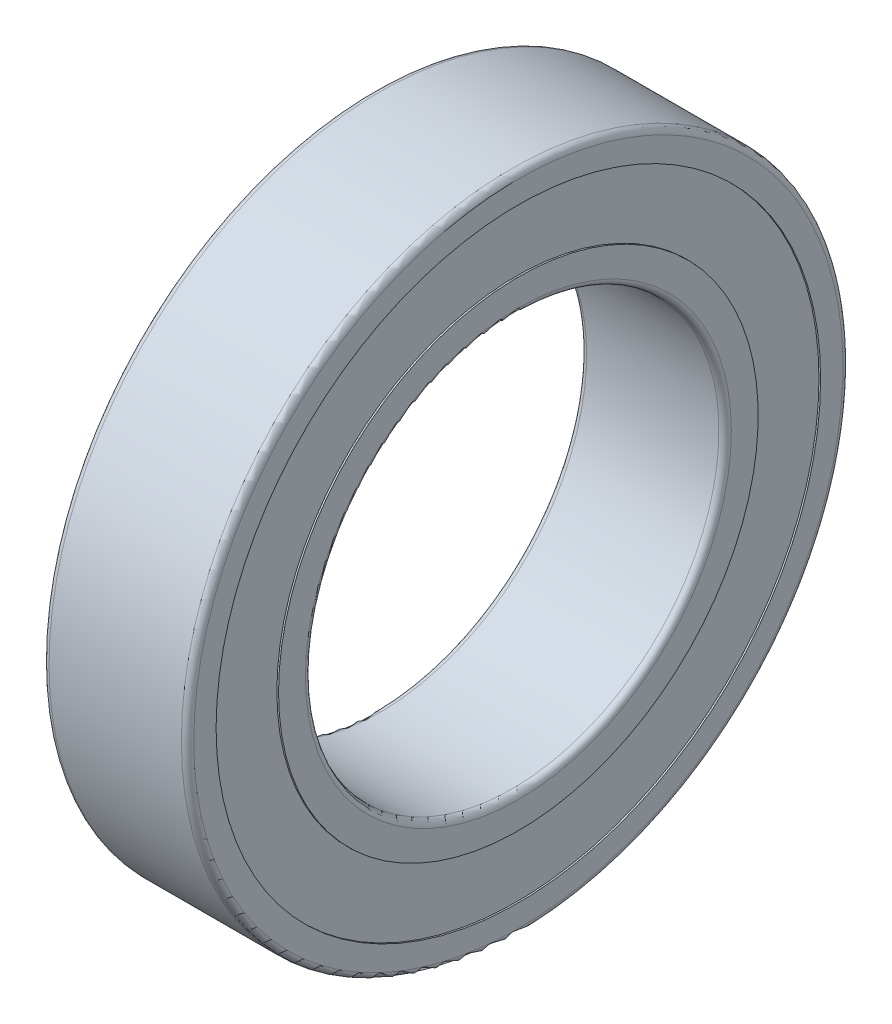
ISO-10303-21;
HEADER;
FILE_DESCRIPTION(('STEP AP214'),'2;1');
FILE_NAME('part.step','',(''),(''),'','','');
FILE_SCHEMA(('AUTOMOTIVE_DESIGN { 1 0 10303 214 1 1 1 1 }'));
ENDSEC;
DATA;
#1=APPLICATION_CONTEXT('core data for automotive mechanical design processes');
#2=APPLICATION_PROTOCOL_DEFINITION('international standard','automotive_design',2000,#1);
#3=PRODUCT_CONTEXT('',#1,'mechanical');
#4=PRODUCT('Part','Part','',(#3));
#5=PRODUCT_RELATED_PRODUCT_CATEGORY('part','',(#4));
#6=PRODUCT_DEFINITION_FORMATION('','',#4);
#7=PRODUCT_DEFINITION_CONTEXT('part definition',#1,'design');
#8=PRODUCT_DEFINITION('design','',#6,#7);
#9=PRODUCT_DEFINITION_SHAPE('','',#8);
#10=(LENGTH_UNIT() NAMED_UNIT(*) SI_UNIT(.MILLI.,.METRE.));
#11=(NAMED_UNIT(*) PLANE_ANGLE_UNIT() SI_UNIT($,.RADIAN.));
#12=(NAMED_UNIT(*) SI_UNIT($,.STERADIAN.) SOLID_ANGLE_UNIT());
#13=UNCERTAINTY_MEASURE_WITH_UNIT(LENGTH_MEASURE(1.E-05),#10,'distance_accuracy_value','');
#14=(GEOMETRIC_REPRESENTATION_CONTEXT(3) GLOBAL_UNCERTAINTY_ASSIGNED_CONTEXT((#13)) GLOBAL_UNIT_ASSIGNED_CONTEXT((#10,
#11,#12)) REPRESENTATION_CONTEXT('',''));
#15=CARTESIAN_POINT('',(0.,0.,0.));
#16=DIRECTION('',(0.,0.,1.));
#17=DIRECTION('',(1.,0.,0.));
#18=AXIS2_PLACEMENT_3D('',#15,#16,#17);
#19=CARTESIAN_POINT('',(0.,-11.9169579088422,-11.6));
#20=DIRECTION('',(-1.,0.,0.));
#21=DIRECTION('',(0.,0.,1.));
#22=AXIS2_PLACEMENT_3D('',#19,#20,#21);
#23=PLANE('',#22);
#24=CARTESIAN_POINT('',(0.,0.,0.));
#25=DIRECTION('',(-1.,0.,0.));
#26=DIRECTION('',(0.,0.,-1.));
#27=AXIS2_PLACEMENT_3D('',#24,#25,#26);
#28=CIRCLE('',#27,11.6);
#29=CARTESIAN_POINT('',(0.,0.,-11.6));
#30=VERTEX_POINT('',#29);
#31=EDGE_CURVE('E68',#30,#30,#28,.F.);
#32=ORIENTED_EDGE('',*,*,#31,.F.);
#33=EDGE_LOOP('',(#32));
#34=FACE_BOUND('',#33,.T.);
#35=CARTESIAN_POINT('',(0.,0.,0.));
#36=DIRECTION('',(1.,0.,0.));
#37=DIRECTION('',(0.,0.,1.));
#38=AXIS2_PLACEMENT_3D('',#35,#36,#37);
#39=CIRCLE('',#38,10.3);
#40=CARTESIAN_POINT('',(0.,0.,10.3));
#41=VERTEX_POINT('',#40);
#42=EDGE_CURVE('E65',#41,#41,#39,.T.);
#43=ORIENTED_EDGE('',*,*,#42,.T.);
#44=EDGE_LOOP('',(#43));
#45=FACE_BOUND('',#44,.T.);
#46=ADVANCED_FACE('F15',(#34,#45),#23,.T.);
#47=CARTESIAN_POINT('',(7.,-11.9169579088422,11.6));
#48=DIRECTION('',(1.,0.,0.));
#49=DIRECTION('',(0.,0.,-1.));
#50=AXIS2_PLACEMENT_3D('',#47,#48,#49);
#51=PLANE('',#50);
#52=CARTESIAN_POINT('',(7.,0.,0.));
#53=DIRECTION('',(1.,0.,0.));
#54=DIRECTION('',(0.,0.,1.));
#55=AXIS2_PLACEMENT_3D('',#52,#53,#54);
#56=CIRCLE('',#55,11.6);
#57=CARTESIAN_POINT('',(7.,0.,11.6));
#58=VERTEX_POINT('',#57);
#59=EDGE_CURVE('E62',#58,#58,#56,.T.);
#60=ORIENTED_EDGE('',*,*,#59,.T.);
#61=EDGE_LOOP('',(#60));
#62=FACE_BOUND('',#61,.T.);
#63=CARTESIAN_POINT('',(7.,0.,0.));
#64=DIRECTION('',(-1.,0.,0.));
#65=DIRECTION('',(0.,0.,-1.));
#66=AXIS2_PLACEMENT_3D('',#63,#64,#65);
#67=CIRCLE('',#66,10.3);
#68=CARTESIAN_POINT('',(7.,0.,-10.3));
#69=VERTEX_POINT('',#68);
#70=EDGE_CURVE('E59',#69,#69,#67,.F.);
#71=ORIENTED_EDGE('',*,*,#70,.F.);
#72=EDGE_LOOP('',(#71));
#73=FACE_BOUND('',#72,.T.);
#74=ADVANCED_FACE('F76',(#62,#73),#51,.T.);
#75=CARTESIAN_POINT('',(6.9195,-14.8915861455195,14.62));
#76=DIRECTION('',(1.,0.,0.));
#77=DIRECTION('',(0.,0.,-1.));
#78=AXIS2_PLACEMENT_3D('',#75,#76,#77);
#79=PLANE('',#78);
#80=CARTESIAN_POINT('',(6.9195,0.,0.));
#81=DIRECTION('',(1.,0.,0.));
#82=DIRECTION('',(0.,0.,1.));
#83=AXIS2_PLACEMENT_3D('',#80,#81,#82);
#84=CIRCLE('',#83,14.62);
#85=CARTESIAN_POINT('',(6.9195,0.,14.62));
#86=VERTEX_POINT('',#85);
#87=EDGE_CURVE('E56',#86,#86,#84,.T.);
#88=ORIENTED_EDGE('',*,*,#87,.T.);
#89=EDGE_LOOP('',(#88));
#90=FACE_BOUND('',#89,.T.);
#91=CARTESIAN_POINT('',(6.9195,0.,0.));
#92=DIRECTION('',(-1.,0.,0.));
#93=DIRECTION('',(0.,0.,-1.));
#94=AXIS2_PLACEMENT_3D('',#91,#92,#93);
#95=CIRCLE('',#94,11.6);
#96=CARTESIAN_POINT('',(6.9195,0.,-11.6));
#97=VERTEX_POINT('',#96);
#98=EDGE_CURVE('E53',#97,#97,#95,.F.);
#99=ORIENTED_EDGE('',*,*,#98,.F.);
#100=EDGE_LOOP('',(#99));
#101=FACE_BOUND('',#100,.T.);
#102=ADVANCED_FACE('F135',(#90,#101),#79,.T.);
#103=CARTESIAN_POINT('',(7.,-15.9916485694488,15.7));
#104=DIRECTION('',(1.,0.,0.));
#105=DIRECTION('',(0.,0.,-1.));
#106=AXIS2_PLACEMENT_3D('',#103,#104,#105);
#107=PLANE('',#106);
#108=CARTESIAN_POINT('',(7.,0.,0.));
#109=DIRECTION('',(1.,0.,0.));
#110=DIRECTION('',(0.,-1.16842937307115E-09,1.));
#111=AXIS2_PLACEMENT_3D('',#108,#109,#110);
#112=CIRCLE('',#111,15.7);
#113=CARTESIAN_POINT('',(7.,-1.83443411572171E-08,15.7));
#114=VERTEX_POINT('',#113);
#115=EDGE_CURVE('E50',#114,#114,#112,.T.);
#116=ORIENTED_EDGE('',*,*,#115,.T.);
#117=EDGE_LOOP('',(#116));
#118=FACE_BOUND('',#117,.T.);
#119=CARTESIAN_POINT('',(7.,0.,0.));
#120=DIRECTION('',(-1.,0.,0.));
#121=DIRECTION('',(0.,0.,-1.));
#122=AXIS2_PLACEMENT_3D('',#119,#120,#121);
#123=CIRCLE('',#122,14.62);
#124=CARTESIAN_POINT('',(7.,0.,-14.62));
#125=VERTEX_POINT('',#124);
#126=EDGE_CURVE('E47',#125,#125,#123,.F.);
#127=ORIENTED_EDGE('',*,*,#126,.F.);
#128=EDGE_LOOP('',(#127));
#129=FACE_BOUND('',#128,.T.);
#130=ADVANCED_FACE('F130',(#118,#129),#107,.T.);
#131=CARTESIAN_POINT('',(0.,-15.9916485967617,-15.7));
#132=DIRECTION('',(-1.,0.,0.));
#133=DIRECTION('',(0.,0.,1.));
#134=AXIS2_PLACEMENT_3D('',#131,#132,#133);
#135=PLANE('',#134);
#136=CARTESIAN_POINT('',(0.,0.,0.));
#137=DIRECTION('',(-1.,0.,0.));
#138=DIRECTION('',(0.,0.,-1.));
#139=AXIS2_PLACEMENT_3D('',#136,#137,#138);
#140=CIRCLE('',#139,15.7);
#141=CARTESIAN_POINT('',(0.,0.,-15.7));
#142=VERTEX_POINT('',#141);
#143=EDGE_CURVE('E44',#142,#142,#140,.F.);
#144=ORIENTED_EDGE('',*,*,#143,.F.);
#145=EDGE_LOOP('',(#144));
#146=FACE_BOUND('',#145,.T.);
#147=CARTESIAN_POINT('',(0.,0.,0.));
#148=DIRECTION('',(1.,0.,0.));
#149=DIRECTION('',(0.,0.,1.));
#150=AXIS2_PLACEMENT_3D('',#147,#148,#149);
#151=CIRCLE('',#150,14.62);
#152=CARTESIAN_POINT('',(0.,0.,14.62));
#153=VERTEX_POINT('',#152);
#154=EDGE_CURVE('E41',#153,#153,#151,.T.);
#155=ORIENTED_EDGE('',*,*,#154,.T.);
#156=EDGE_LOOP('',(#155));
#157=FACE_BOUND('',#156,.T.);
#158=ADVANCED_FACE('F94',(#146,#157),#135,.T.);
#159=CARTESIAN_POINT('',(0.0805,-14.8915861455195,-14.62));
#160=DIRECTION('',(-1.,0.,0.));
#161=DIRECTION('',(0.,0.,1.));
#162=AXIS2_PLACEMENT_3D('',#159,#160,#161);
#163=PLANE('',#162);
#164=CARTESIAN_POINT('',(0.0805,0.,0.));
#165=DIRECTION('',(-1.,0.,0.));
#166=DIRECTION('',(0.,0.,-1.));
#167=AXIS2_PLACEMENT_3D('',#164,#165,#166);
#168=CIRCLE('',#167,14.62);
#169=CARTESIAN_POINT('',(0.0805,0.,-14.62));
#170=VERTEX_POINT('',#169);
#171=EDGE_CURVE('E38',#170,#170,#168,.F.);
#172=ORIENTED_EDGE('',*,*,#171,.F.);
#173=EDGE_LOOP('',(#172));
#174=FACE_BOUND('',#173,.T.);
#175=CARTESIAN_POINT('',(0.0805,0.,0.));
#176=DIRECTION('',(1.,0.,0.));
#177=DIRECTION('',(0.,0.,1.));
#178=AXIS2_PLACEMENT_3D('',#175,#176,#177);
#179=CIRCLE('',#178,11.6);
#180=CARTESIAN_POINT('',(0.0805,0.,11.6));
#181=VERTEX_POINT('',#180);
#182=EDGE_CURVE('E35',#181,#181,#179,.T.);
#183=ORIENTED_EDGE('',*,*,#182,.T.);
#184=EDGE_LOOP('',(#183));
#185=FACE_BOUND('',#184,.T.);
#186=ADVANCED_FACE('F83',(#174,#185),#163,.T.);
#187=CARTESIAN_POINT('',(0.299999999999938,0.,0.));
#188=DIRECTION('',(1.,0.,0.));
#189=DIRECTION('',(0.,0.,1.));
#190=AXIS2_PLACEMENT_3D('',#187,#188,#189);
#191=TOROIDAL_SURFACE('',#190,10.3,0.299999999999938);
#192=CARTESIAN_POINT('',(0.3,0.,0.));
#193=DIRECTION('',(1.,0.,0.));
#194=DIRECTION('',(0.,0.,1.));
#195=AXIS2_PLACEMENT_3D('',#192,#193,#194);
#196=CIRCLE('',#195,10.0000000000001);
#197=CARTESIAN_POINT('',(0.3,0.,10.0000000000001));
#198=VERTEX_POINT('',#197);
#199=EDGE_CURVE('E30',#198,#198,#196,.T.);
#200=ORIENTED_EDGE('',*,*,#199,.T.);
#201=EDGE_LOOP('',(#200));
#202=FACE_BOUND('',#201,.T.);
#203=ORIENTED_EDGE('',*,*,#42,.F.);
#204=EDGE_LOOP('',(#203));
#205=FACE_BOUND('',#204,.T.);
#206=ADVANCED_FACE('F80',(#202,#205),#191,.T.);
#207=CARTESIAN_POINT('',(7.,0.,0.));
#208=DIRECTION('',(1.,0.,0.));
#209=DIRECTION('',(0.,0.,1.));
#210=AXIS2_PLACEMENT_3D('',#207,#208,#209);
#211=CYLINDRICAL_SURFACE('',#210,10.);
#212=CARTESIAN_POINT('',(6.7,0.,0.));
#213=DIRECTION('',(1.,0.,0.));
#214=DIRECTION('',(0.,0.,1.));
#215=AXIS2_PLACEMENT_3D('',#212,#213,#214);
#216=CIRCLE('',#215,10.);
#217=CARTESIAN_POINT('',(6.7,0.,10.));
#218=VERTEX_POINT('',#217);
#219=EDGE_CURVE('E26',#218,#218,#216,.T.);
#220=ORIENTED_EDGE('',*,*,#219,.T.);
#221=EDGE_LOOP('',(#220));
#222=FACE_BOUND('',#221,.T.);
#223=ORIENTED_EDGE('',*,*,#199,.F.);
#224=EDGE_LOOP('',(#223));
#225=FACE_BOUND('',#224,.T.);
#226=ADVANCED_FACE('F82',(#222,#225),#211,.F.);
#227=CARTESIAN_POINT('',(6.70000000000012,0.,0.));
#228=DIRECTION('',(1.,0.,0.));
#229=DIRECTION('',(0.,0.,1.));
#230=AXIS2_PLACEMENT_3D('',#227,#228,#229);
#231=TOROIDAL_SURFACE('',#230,10.2999999999999,0.299999999999877);
#232=ORIENTED_EDGE('',*,*,#70,.T.);
#233=EDGE_LOOP('',(#232));
#234=FACE_BOUND('',#233,.T.);
#235=ORIENTED_EDGE('',*,*,#219,.F.);
#236=EDGE_LOOP('',(#235));
#237=FACE_BOUND('',#236,.T.);
#238=ADVANCED_FACE('F91',(#234,#237),#231,.T.);
#239=CARTESIAN_POINT('',(7.,0.,0.));
#240=DIRECTION('',(1.,0.,0.));
#241=DIRECTION('',(0.,0.,1.));
#242=AXIS2_PLACEMENT_3D('',#239,#240,#241);
#243=CYLINDRICAL_SURFACE('',#242,11.6);
#244=ORIENTED_EDGE('',*,*,#98,.T.);
#245=EDGE_LOOP('',(#244));
#246=FACE_BOUND('',#245,.T.);
#247=ORIENTED_EDGE('',*,*,#59,.F.);
#248=EDGE_LOOP('',(#247));
#249=FACE_BOUND('',#248,.T.);
#250=ADVANCED_FACE('F101',(#246,#249),#243,.T.);
#251=CARTESIAN_POINT('',(7.,0.,0.));
#252=DIRECTION('',(1.,0.,0.));
#253=DIRECTION('',(0.,0.,1.));
#254=AXIS2_PLACEMENT_3D('',#251,#252,#253);
#255=CYLINDRICAL_SURFACE('',#254,14.62);
#256=ORIENTED_EDGE('',*,*,#126,.T.);
#257=EDGE_LOOP('',(#256));
#258=FACE_BOUND('',#257,.T.);
#259=ORIENTED_EDGE('',*,*,#87,.F.);
#260=EDGE_LOOP('',(#259));
#261=FACE_BOUND('',#260,.T.);
#262=ADVANCED_FACE('F105',(#258,#261),#255,.F.);
#263=CARTESIAN_POINT('',(6.70000000000012,0.,0.));
#264=DIRECTION('',(1.,0.,0.));
#265=DIRECTION('',(0.,0.,1.));
#266=AXIS2_PLACEMENT_3D('',#263,#264,#265);
#267=TOROIDAL_SURFACE('',#266,15.7,0.29999999999988);
#268=CARTESIAN_POINT('',(6.70000000000012,0.,0.));
#269=DIRECTION('',(1.,0.,0.));
#270=DIRECTION('',(0.,0.,1.));
#271=AXIS2_PLACEMENT_3D('',#268,#269,#270);
#272=CIRCLE('',#271,15.9999999999999);
#273=CARTESIAN_POINT('',(6.70000000000012,0.,15.9999999999999));
#274=VERTEX_POINT('',#273);
#275=EDGE_CURVE('E22',#274,#274,#272,.T.);
#276=ORIENTED_EDGE('',*,*,#275,.T.);
#277=EDGE_LOOP('',(#276));
#278=FACE_BOUND('',#277,.T.);
#279=ORIENTED_EDGE('',*,*,#115,.F.);
#280=EDGE_LOOP('',(#279));
#281=FACE_BOUND('',#280,.T.);
#282=ADVANCED_FACE('F109',(#278,#281),#267,.T.);
#283=CARTESIAN_POINT('',(7.,0.,0.));
#284=DIRECTION('',(1.,0.,0.));
#285=DIRECTION('',(0.,0.,1.));
#286=AXIS2_PLACEMENT_3D('',#283,#284,#285);
#287=CYLINDRICAL_SURFACE('',#286,16.);
#288=CARTESIAN_POINT('',(0.3,0.,0.));
#289=DIRECTION('',(1.,0.,0.));
#290=DIRECTION('',(0.,0.,1.));
#291=AXIS2_PLACEMENT_3D('',#288,#289,#290);
#292=CIRCLE('',#291,16.);
#293=CARTESIAN_POINT('',(0.3,0.,16.));
#294=VERTEX_POINT('',#293);
#295=EDGE_CURVE('E10',#294,#294,#292,.T.);
#296=ORIENTED_EDGE('',*,*,#295,.T.);
#297=EDGE_LOOP('',(#296));
#298=FACE_BOUND('',#297,.T.);
#299=ORIENTED_EDGE('',*,*,#275,.F.);
#300=EDGE_LOOP('',(#299));
#301=FACE_BOUND('',#300,.T.);
#302=ADVANCED_FACE('F113',(#298,#301),#287,.T.);
#303=CARTESIAN_POINT('',(0.299999999999941,0.,0.));
#304=DIRECTION('',(1.,0.,0.));
#305=DIRECTION('',(0.,0.,1.));
#306=AXIS2_PLACEMENT_3D('',#303,#304,#305);
#307=TOROIDAL_SURFACE('',#306,15.7,0.299999999999939);
#308=ORIENTED_EDGE('',*,*,#143,.T.);
#309=EDGE_LOOP('',(#308));
#310=FACE_BOUND('',#309,.T.);
#311=ORIENTED_EDGE('',*,*,#295,.F.);
#312=EDGE_LOOP('',(#311));
#313=FACE_BOUND('',#312,.T.);
#314=ADVANCED_FACE('F116',(#310,#313),#307,.T.);
#315=CARTESIAN_POINT('',(7.,0.,0.));
#316=DIRECTION('',(1.,0.,0.));
#317=DIRECTION('',(0.,0.,1.));
#318=AXIS2_PLACEMENT_3D('',#315,#316,#317);
#319=CYLINDRICAL_SURFACE('',#318,14.62);
#320=ORIENTED_EDGE('',*,*,#171,.T.);
#321=EDGE_LOOP('',(#320));
#322=FACE_BOUND('',#321,.T.);
#323=ORIENTED_EDGE('',*,*,#154,.F.);
#324=EDGE_LOOP('',(#323));
#325=FACE_BOUND('',#324,.T.);
#326=ADVANCED_FACE('F118',(#322,#325),#319,.F.);
#327=CARTESIAN_POINT('',(7.,0.,0.));
#328=DIRECTION('',(1.,0.,0.));
#329=DIRECTION('',(0.,0.,1.));
#330=AXIS2_PLACEMENT_3D('',#327,#328,#329);
#331=CYLINDRICAL_SURFACE('',#330,11.6);
#332=ORIENTED_EDGE('',*,*,#31,.T.);
#333=EDGE_LOOP('',(#332));
#334=FACE_BOUND('',#333,.T.);
#335=ORIENTED_EDGE('',*,*,#182,.F.);
#336=EDGE_LOOP('',(#335));
#337=FACE_BOUND('',#336,.T.);
#338=ADVANCED_FACE('F17',(#334,#337),#331,.T.);
#339=CLOSED_SHELL('',(#46,#74,#102,#130,#158,#186,#206,#226,#238,#250,#262,#282,#302,#314,#326,#338));
#340=MANIFOLD_SOLID_BREP('B1',#339);
#341=ADVANCED_BREP_SHAPE_REPRESENTATION('',(#18,#340),#14);
#342=SHAPE_DEFINITION_REPRESENTATION(#9,#341);
ENDSEC;
END-ISO-10303-21;
